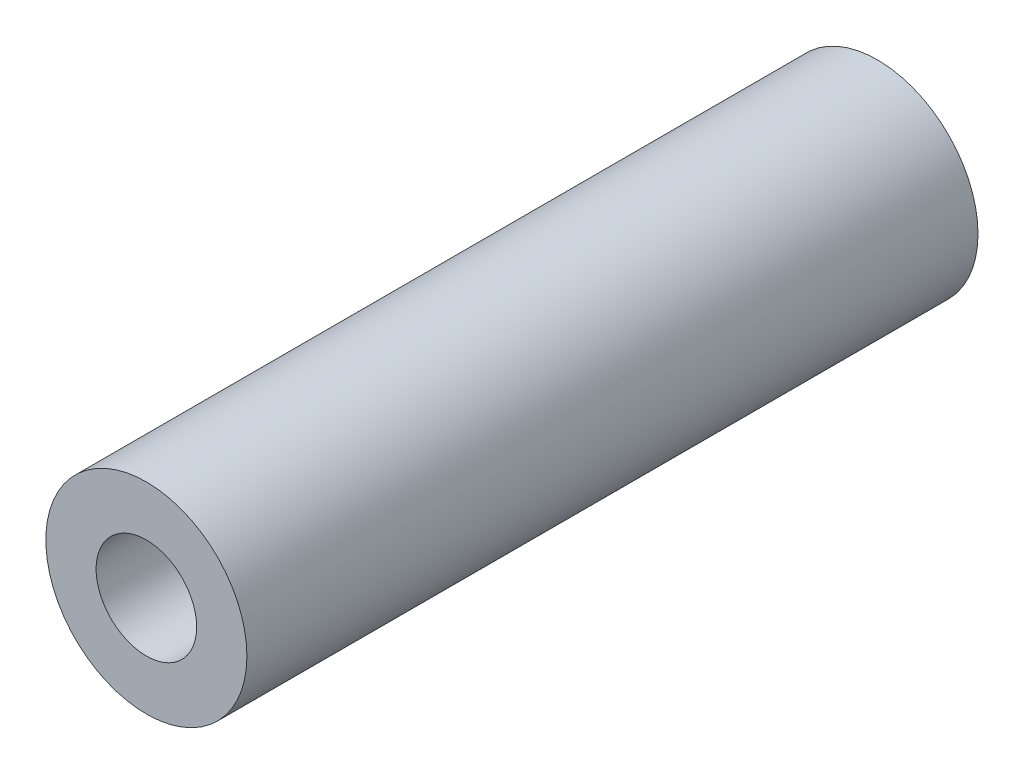
ISO-10303-21;
HEADER;
FILE_DESCRIPTION(('STEP AP214'),'2;1');
FILE_NAME('part.step','',(''),(''),'','','');
FILE_SCHEMA(('AUTOMOTIVE_DESIGN { 1 0 10303 214 1 1 1 1 }'));
ENDSEC;
DATA;
#1=APPLICATION_CONTEXT('core data for automotive mechanical design processes');
#2=APPLICATION_PROTOCOL_DEFINITION('international standard','automotive_design',2000,#1);
#3=PRODUCT_CONTEXT('',#1,'mechanical');
#4=PRODUCT('Part','Part','',(#3));
#5=PRODUCT_RELATED_PRODUCT_CATEGORY('part','',(#4));
#6=PRODUCT_DEFINITION_FORMATION('','',#4);
#7=PRODUCT_DEFINITION_CONTEXT('part definition',#1,'design');
#8=PRODUCT_DEFINITION('design','',#6,#7);
#9=PRODUCT_DEFINITION_SHAPE('','',#8);
#10=(LENGTH_UNIT() NAMED_UNIT(*) SI_UNIT(.MILLI.,.METRE.));
#11=(NAMED_UNIT(*) PLANE_ANGLE_UNIT() SI_UNIT($,.RADIAN.));
#12=(NAMED_UNIT(*) SI_UNIT($,.STERADIAN.) SOLID_ANGLE_UNIT());
#13=UNCERTAINTY_MEASURE_WITH_UNIT(LENGTH_MEASURE(1.E-05),#10,'distance_accuracy_value','');
#14=(GEOMETRIC_REPRESENTATION_CONTEXT(3) GLOBAL_UNCERTAINTY_ASSIGNED_CONTEXT((#13)) GLOBAL_UNIT_ASSIGNED_CONTEXT((#10,
#11,#12)) REPRESENTATION_CONTEXT('',''));
#15=CARTESIAN_POINT('',(0.,0.,0.));
#16=DIRECTION('',(0.,0.,1.));
#17=DIRECTION('',(1.,0.,0.));
#18=AXIS2_PLACEMENT_3D('',#15,#16,#17);
#19=CARTESIAN_POINT('',(0.,0.,40.));
#20=DIRECTION('',(0.,0.,1.));
#21=DIRECTION('',(1.,0.,0.));
#22=AXIS2_PLACEMENT_3D('',#19,#20,#21);
#23=PLANE('',#22);
#24=CARTESIAN_POINT('',(0.,0.,40.));
#25=DIRECTION('',(0.,0.,1.));
#26=DIRECTION('',(1.,0.,0.));
#27=AXIS2_PLACEMENT_3D('',#24,#25,#26);
#28=CIRCLE('',#27,11.);
#29=CARTESIAN_POINT('',(11.,0.,40.));
#30=VERTEX_POINT('',#29);
#31=EDGE_CURVE('E10',#30,#30,#28,.T.);
#32=ORIENTED_EDGE('',*,*,#31,.T.);
#33=EDGE_LOOP('',(#32));
#34=FACE_BOUND('',#33,.T.);
#35=CARTESIAN_POINT('',(0.,0.,40.));
#36=DIRECTION('',(0.,0.,1.));
#37=DIRECTION('',(1.,0.,0.));
#38=AXIS2_PLACEMENT_3D('',#35,#36,#37);
#39=CIRCLE('',#38,5.5);
#40=CARTESIAN_POINT('',(5.5,0.,40.));
#41=VERTEX_POINT('',#40);
#42=EDGE_CURVE('E42',#41,#41,#39,.T.);
#43=ORIENTED_EDGE('',*,*,#42,.F.);
#44=EDGE_LOOP('',(#43));
#45=FACE_BOUND('',#44,.T.);
#46=ADVANCED_FACE('F31',(#34,#45),#23,.T.);
#47=CARTESIAN_POINT('',(0.,0.,-40.));
#48=DIRECTION('',(0.,0.,1.));
#49=DIRECTION('',(1.,0.,0.));
#50=AXIS2_PLACEMENT_3D('',#47,#48,#49);
#51=PLANE('',#50);
#52=CARTESIAN_POINT('',(0.,0.,-40.));
#53=DIRECTION('',(0.,0.,1.));
#54=DIRECTION('',(1.,0.,0.));
#55=AXIS2_PLACEMENT_3D('',#52,#53,#54);
#56=CIRCLE('',#55,11.);
#57=CARTESIAN_POINT('',(11.,0.,-40.));
#58=VERTEX_POINT('',#57);
#59=EDGE_CURVE('E35',#58,#58,#56,.T.);
#60=ORIENTED_EDGE('',*,*,#59,.F.);
#61=EDGE_LOOP('',(#60));
#62=FACE_BOUND('',#61,.T.);
#63=CARTESIAN_POINT('',(0.,0.,-40.));
#64=DIRECTION('',(0.,0.,1.));
#65=DIRECTION('',(1.,0.,0.));
#66=AXIS2_PLACEMENT_3D('',#63,#64,#65);
#67=CIRCLE('',#66,5.5);
#68=CARTESIAN_POINT('',(5.5,0.,-40.));
#69=VERTEX_POINT('',#68);
#70=EDGE_CURVE('E44',#69,#69,#67,.T.);
#71=ORIENTED_EDGE('',*,*,#70,.T.);
#72=EDGE_LOOP('',(#71));
#73=FACE_BOUND('',#72,.T.);
#74=ADVANCED_FACE('F54',(#62,#73),#51,.F.);
#75=CARTESIAN_POINT('',(0.,0.,40.));
#76=DIRECTION('',(0.,0.,-1.));
#77=DIRECTION('',(-1.,0.,0.));
#78=AXIS2_PLACEMENT_3D('',#75,#76,#77);
#79=CYLINDRICAL_SURFACE('',#78,11.);
#80=ORIENTED_EDGE('',*,*,#31,.F.);
#81=EDGE_LOOP('',(#80));
#82=FACE_BOUND('',#81,.T.);
#83=ORIENTED_EDGE('',*,*,#59,.T.);
#84=EDGE_LOOP('',(#83));
#85=FACE_BOUND('',#84,.T.);
#86=ADVANCED_FACE('F33',(#82,#85),#79,.T.);
#87=CARTESIAN_POINT('',(0.,0.,40.));
#88=DIRECTION('',(0.,0.,-1.));
#89=DIRECTION('',(-1.,0.,0.));
#90=AXIS2_PLACEMENT_3D('',#87,#88,#89);
#91=CYLINDRICAL_SURFACE('',#90,5.5);
#92=ORIENTED_EDGE('',*,*,#42,.T.);
#93=EDGE_LOOP('',(#92));
#94=FACE_BOUND('',#93,.T.);
#95=ORIENTED_EDGE('',*,*,#70,.F.);
#96=EDGE_LOOP('',(#95));
#97=FACE_BOUND('',#96,.T.);
#98=ADVANCED_FACE('F50',(#94,#97),#91,.F.);
#99=CLOSED_SHELL('',(#46,#74,#86,#98));
#100=MANIFOLD_SOLID_BREP('B2',#99);
#101=ADVANCED_BREP_SHAPE_REPRESENTATION('',(#18,#100),#14);
#102=SHAPE_DEFINITION_REPRESENTATION(#9,#101);
ENDSEC;
END-ISO-10303-21;
